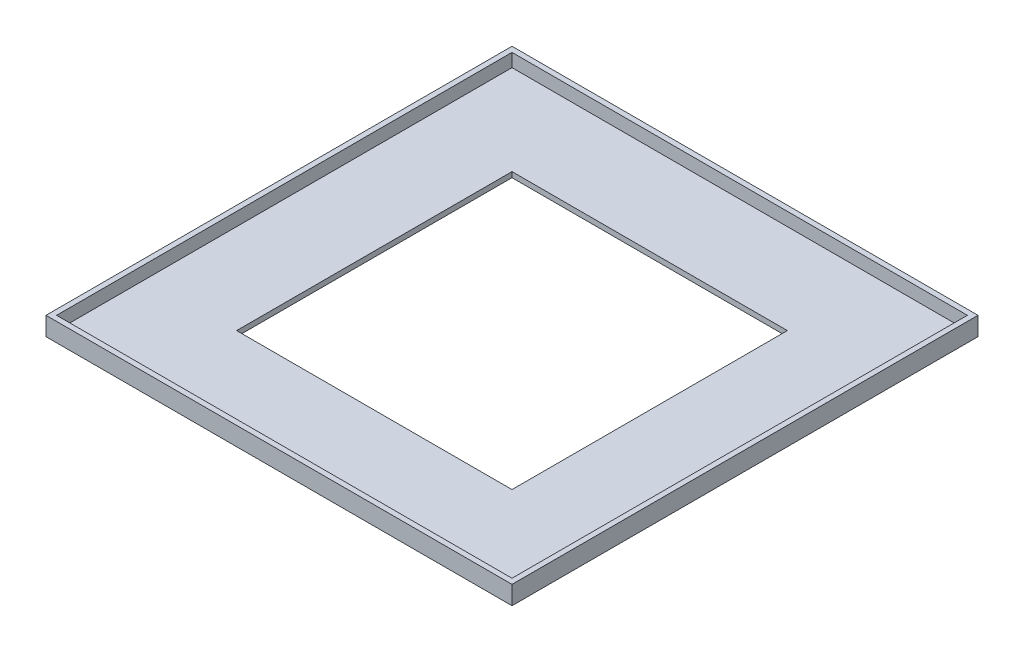
ISO-10303-21;
HEADER;
FILE_DESCRIPTION(('STEP AP214'),'2;1');
FILE_NAME('part.step','',(''),(''),'','','');
FILE_SCHEMA(('AUTOMOTIVE_DESIGN { 1 0 10303 214 1 1 1 1 }'));
ENDSEC;
DATA;
#1=APPLICATION_CONTEXT('core data for automotive mechanical design processes');
#2=APPLICATION_PROTOCOL_DEFINITION('international standard','automotive_design',2000,#1);
#3=PRODUCT_CONTEXT('',#1,'mechanical');
#4=PRODUCT('Part','Part','',(#3));
#5=PRODUCT_RELATED_PRODUCT_CATEGORY('part','',(#4));
#6=PRODUCT_DEFINITION_FORMATION('','',#4);
#7=PRODUCT_DEFINITION_CONTEXT('part definition',#1,'design');
#8=PRODUCT_DEFINITION('design','',#6,#7);
#9=PRODUCT_DEFINITION_SHAPE('','',#8);
#10=(LENGTH_UNIT() NAMED_UNIT(*) SI_UNIT(.MILLI.,.METRE.));
#11=(NAMED_UNIT(*) PLANE_ANGLE_UNIT() SI_UNIT($,.RADIAN.));
#12=(NAMED_UNIT(*) SI_UNIT($,.STERADIAN.) SOLID_ANGLE_UNIT());
#13=UNCERTAINTY_MEASURE_WITH_UNIT(LENGTH_MEASURE(1.E-05),#10,'distance_accuracy_value','');
#14=(GEOMETRIC_REPRESENTATION_CONTEXT(3) GLOBAL_UNCERTAINTY_ASSIGNED_CONTEXT((#13)) GLOBAL_UNIT_ASSIGNED_CONTEXT((#10,
#11,#12)) REPRESENTATION_CONTEXT('',''));
#15=CARTESIAN_POINT('',(0.,0.,0.));
#16=DIRECTION('',(0.,0.,1.));
#17=DIRECTION('',(1.,0.,0.));
#18=AXIS2_PLACEMENT_3D('',#15,#16,#17);
#19=CARTESIAN_POINT('',(44.,3.5,-44.));
#20=DIRECTION('',(-1.,0.,0.));
#21=DIRECTION('',(0.,0.,1.));
#22=AXIS2_PLACEMENT_3D('',#19,#20,#21);
#23=PLANE('',#22);
#24=DIRECTION('',(0.,0.,-1.));
#25=VECTOR('',#24,1.);
#26=CARTESIAN_POINT('',(44.,0.,-44.));
#27=LINE('',#26,#25);
#28=CARTESIAN_POINT('',(44.,0.,44.));
#29=VERTEX_POINT('',#28);
#30=CARTESIAN_POINT('',(44.,0.,-44.));
#31=VERTEX_POINT('',#30);
#32=EDGE_CURVE('E185',#29,#31,#27,.T.);
#33=ORIENTED_EDGE('',*,*,#32,.T.);
#34=DIRECTION('',(0.,-1.,0.));
#35=VECTOR('',#34,1.);
#36=CARTESIAN_POINT('',(44.,3.5,-44.));
#37=LINE('',#36,#35);
#38=CARTESIAN_POINT('',(44.,3.5,-44.));
#39=VERTEX_POINT('',#38);
#40=EDGE_CURVE('E11',#39,#31,#37,.T.);
#41=ORIENTED_EDGE('',*,*,#40,.F.);
#42=DIRECTION('',(0.,0.,-1.));
#43=VECTOR('',#42,1.);
#44=CARTESIAN_POINT('',(44.,3.5,-44.));
#45=LINE('',#44,#43);
#46=CARTESIAN_POINT('',(44.,3.5,44.));
#47=VERTEX_POINT('',#46);
#48=EDGE_CURVE('E192',#47,#39,#45,.T.);
#49=ORIENTED_EDGE('',*,*,#48,.F.);
#50=DIRECTION('',(0.,-1.,0.));
#51=VECTOR('',#50,1.);
#52=CARTESIAN_POINT('',(44.,3.5,44.));
#53=LINE('',#52,#51);
#54=EDGE_CURVE('E202',#47,#29,#53,.T.);
#55=ORIENTED_EDGE('',*,*,#54,.T.);
#56=EDGE_LOOP('',(#33,#41,#49,#55));
#57=FACE_BOUND('',#56,.T.);
#58=ADVANCED_FACE('F34',(#57),#23,.F.);
#59=CARTESIAN_POINT('',(-44.,3.5,-44.));
#60=DIRECTION('',(0.,0.,1.));
#61=DIRECTION('',(1.,0.,0.));
#62=AXIS2_PLACEMENT_3D('',#59,#60,#61);
#63=PLANE('',#62);
#64=DIRECTION('',(-1.,0.,0.));
#65=VECTOR('',#64,1.);
#66=CARTESIAN_POINT('',(-44.,0.,-44.));
#67=LINE('',#66,#65);
#68=CARTESIAN_POINT('',(-44.,0.,-44.));
#69=VERTEX_POINT('',#68);
#70=EDGE_CURVE('E205',#31,#69,#67,.T.);
#71=ORIENTED_EDGE('',*,*,#70,.T.);
#72=DIRECTION('',(0.,-1.,0.));
#73=VECTOR('',#72,1.);
#74=CARTESIAN_POINT('',(-44.,3.5,-44.));
#75=LINE('',#74,#73);
#76=CARTESIAN_POINT('',(-44.,3.5,-44.));
#77=VERTEX_POINT('',#76);
#78=EDGE_CURVE('E41',#77,#69,#75,.T.);
#79=ORIENTED_EDGE('',*,*,#78,.F.);
#80=DIRECTION('',(-1.,0.,0.));
#81=VECTOR('',#80,1.);
#82=CARTESIAN_POINT('',(-44.,3.5,-44.));
#83=LINE('',#82,#81);
#84=EDGE_CURVE('E195',#39,#77,#83,.T.);
#85=ORIENTED_EDGE('',*,*,#84,.F.);
#86=ORIENTED_EDGE('',*,*,#40,.T.);
#87=EDGE_LOOP('',(#71,#79,#85,#86));
#88=FACE_BOUND('',#87,.T.);
#89=ADVANCED_FACE('F233',(#88),#63,.F.);
#90=CARTESIAN_POINT('',(-44.,3.5,-44.));
#91=DIRECTION('',(1.,0.,0.));
#92=DIRECTION('',(0.,0.,-1.));
#93=AXIS2_PLACEMENT_3D('',#90,#91,#92);
#94=PLANE('',#93);
#95=DIRECTION('',(0.,0.,1.));
#96=VECTOR('',#95,1.);
#97=CARTESIAN_POINT('',(-44.,0.,-44.));
#98=LINE('',#97,#96);
#99=CARTESIAN_POINT('',(-44.,0.,44.));
#100=VERTEX_POINT('',#99);
#101=EDGE_CURVE('E207',#69,#100,#98,.T.);
#102=ORIENTED_EDGE('',*,*,#101,.T.);
#103=DIRECTION('',(0.,-1.,0.));
#104=VECTOR('',#103,1.);
#105=CARTESIAN_POINT('',(-44.,3.5,44.));
#106=LINE('',#105,#104);
#107=CARTESIAN_POINT('',(-44.,3.5,44.));
#108=VERTEX_POINT('',#107);
#109=EDGE_CURVE('E212',#108,#100,#106,.T.);
#110=ORIENTED_EDGE('',*,*,#109,.F.);
#111=DIRECTION('',(0.,0.,1.));
#112=VECTOR('',#111,1.);
#113=CARTESIAN_POINT('',(-44.,3.5,-44.));
#114=LINE('',#113,#112);
#115=EDGE_CURVE('E198',#77,#108,#114,.T.);
#116=ORIENTED_EDGE('',*,*,#115,.F.);
#117=ORIENTED_EDGE('',*,*,#78,.T.);
#118=EDGE_LOOP('',(#102,#110,#116,#117));
#119=FACE_BOUND('',#118,.T.);
#120=ADVANCED_FACE('F219',(#119),#94,.F.);
#121=CARTESIAN_POINT('',(-44.,3.5,44.));
#122=DIRECTION('',(0.,0.,-1.));
#123=DIRECTION('',(-1.,0.,0.));
#124=AXIS2_PLACEMENT_3D('',#121,#122,#123);
#125=PLANE('',#124);
#126=DIRECTION('',(1.,0.,0.));
#127=VECTOR('',#126,1.);
#128=CARTESIAN_POINT('',(-44.,0.,44.));
#129=LINE('',#128,#127);
#130=EDGE_CURVE('E196',#100,#29,#129,.T.);
#131=ORIENTED_EDGE('',*,*,#130,.T.);
#132=ORIENTED_EDGE('',*,*,#54,.F.);
#133=DIRECTION('',(1.,0.,0.));
#134=VECTOR('',#133,1.);
#135=CARTESIAN_POINT('',(-44.,3.5,44.));
#136=LINE('',#135,#134);
#137=EDGE_CURVE('E200',#108,#47,#136,.T.);
#138=ORIENTED_EDGE('',*,*,#137,.F.);
#139=ORIENTED_EDGE('',*,*,#109,.T.);
#140=EDGE_LOOP('',(#131,#132,#138,#139));
#141=FACE_BOUND('',#140,.T.);
#142=ADVANCED_FACE('F226',(#141),#125,.F.);
#143=CARTESIAN_POINT('',(0.,3.5,0.));
#144=DIRECTION('',(0.,1.,0.));
#145=DIRECTION('',(0.,0.,1.));
#146=AXIS2_PLACEMENT_3D('',#143,#144,#145);
#147=PLANE('',#146);
#148=DIRECTION('',(0.,0.,-1.));
#149=VECTOR('',#148,1.);
#150=CARTESIAN_POINT('',(43.,3.5,-43.));
#151=LINE('',#150,#149);
#152=CARTESIAN_POINT('',(43.,3.5,43.));
#153=VERTEX_POINT('',#152);
#154=CARTESIAN_POINT('',(43.,3.5,-43.));
#155=VERTEX_POINT('',#154);
#156=EDGE_CURVE('E156',#153,#155,#151,.T.);
#157=ORIENTED_EDGE('',*,*,#156,.F.);
#158=DIRECTION('',(1.,0.,0.));
#159=VECTOR('',#158,1.);
#160=CARTESIAN_POINT('',(-43.,3.5,43.));
#161=LINE('',#160,#159);
#162=CARTESIAN_POINT('',(-43.,3.5,43.));
#163=VERTEX_POINT('',#162);
#164=EDGE_CURVE('E164',#163,#153,#161,.T.);
#165=ORIENTED_EDGE('',*,*,#164,.F.);
#166=DIRECTION('',(0.,0.,1.));
#167=VECTOR('',#166,1.);
#168=CARTESIAN_POINT('',(-43.,3.5,-43.));
#169=LINE('',#168,#167);
#170=CARTESIAN_POINT('',(-43.,3.5,-43.));
#171=VERTEX_POINT('',#170);
#172=EDGE_CURVE('E178',#171,#163,#169,.T.);
#173=ORIENTED_EDGE('',*,*,#172,.F.);
#174=DIRECTION('',(-1.,0.,0.));
#175=VECTOR('',#174,1.);
#176=CARTESIAN_POINT('',(-43.,3.5,-43.));
#177=LINE('',#176,#175);
#178=EDGE_CURVE('E175',#155,#171,#177,.T.);
#179=ORIENTED_EDGE('',*,*,#178,.F.);
#180=EDGE_LOOP('',(#157,#165,#173,#179));
#181=FACE_BOUND('',#180,.T.);
#182=ORIENTED_EDGE('',*,*,#48,.T.);
#183=ORIENTED_EDGE('',*,*,#84,.T.);
#184=ORIENTED_EDGE('',*,*,#115,.T.);
#185=ORIENTED_EDGE('',*,*,#137,.T.);
#186=EDGE_LOOP('',(#182,#183,#184,#185));
#187=FACE_BOUND('',#186,.T.);
#188=ADVANCED_FACE('F232',(#181,#187),#147,.T.);
#189=CARTESIAN_POINT('',(0.,0.,0.));
#190=DIRECTION('',(0.,1.,0.));
#191=DIRECTION('',(0.,0.,1.));
#192=AXIS2_PLACEMENT_3D('',#189,#190,#191);
#193=PLANE('',#192);
#194=DIRECTION('',(1.,0.,0.));
#195=VECTOR('',#194,1.);
#196=CARTESIAN_POINT('',(-26.,0.,26.));
#197=LINE('',#196,#195);
#198=CARTESIAN_POINT('',(-26.,0.,26.));
#199=VERTEX_POINT('',#198);
#200=CARTESIAN_POINT('',(26.,0.,26.));
#201=VERTEX_POINT('',#200);
#202=EDGE_CURVE('E133',#199,#201,#197,.T.);
#203=ORIENTED_EDGE('',*,*,#202,.T.);
#204=DIRECTION('',(0.,0.,-1.));
#205=VECTOR('',#204,1.);
#206=CARTESIAN_POINT('',(26.,0.,-26.));
#207=LINE('',#206,#205);
#208=CARTESIAN_POINT('',(26.,0.,-26.));
#209=VERTEX_POINT('',#208);
#210=EDGE_CURVE('E125',#201,#209,#207,.T.);
#211=ORIENTED_EDGE('',*,*,#210,.T.);
#212=DIRECTION('',(-1.,0.,0.));
#213=VECTOR('',#212,1.);
#214=CARTESIAN_POINT('',(-26.,0.,-26.));
#215=LINE('',#214,#213);
#216=CARTESIAN_POINT('',(-26.,0.,-26.));
#217=VERTEX_POINT('',#216);
#218=EDGE_CURVE('E136',#209,#217,#215,.T.);
#219=ORIENTED_EDGE('',*,*,#218,.T.);
#220=DIRECTION('',(0.,0.,1.));
#221=VECTOR('',#220,1.);
#222=CARTESIAN_POINT('',(-26.,0.,-26.));
#223=LINE('',#222,#221);
#224=EDGE_CURVE('E53',#217,#199,#223,.T.);
#225=ORIENTED_EDGE('',*,*,#224,.T.);
#226=EDGE_LOOP('',(#203,#211,#219,#225));
#227=FACE_BOUND('',#226,.T.);
#228=ORIENTED_EDGE('',*,*,#32,.F.);
#229=ORIENTED_EDGE('',*,*,#130,.F.);
#230=ORIENTED_EDGE('',*,*,#101,.F.);
#231=ORIENTED_EDGE('',*,*,#70,.F.);
#232=EDGE_LOOP('',(#228,#229,#230,#231));
#233=FACE_BOUND('',#232,.T.);
#234=ADVANCED_FACE('F140',(#227,#233),#193,.F.);
#235=CARTESIAN_POINT('',(43.,1.,-43.));
#236=DIRECTION('',(1.,0.,0.));
#237=DIRECTION('',(0.,0.,-1.));
#238=AXIS2_PLACEMENT_3D('',#235,#236,#237);
#239=PLANE('',#238);
#240=ORIENTED_EDGE('',*,*,#156,.T.);
#241=DIRECTION('',(0.,1.,0.));
#242=VECTOR('',#241,1.);
#243=CARTESIAN_POINT('',(43.,1.,-43.));
#244=LINE('',#243,#242);
#245=CARTESIAN_POINT('',(43.,1.,-43.));
#246=VERTEX_POINT('',#245);
#247=EDGE_CURVE('E173',#246,#155,#244,.T.);
#248=ORIENTED_EDGE('',*,*,#247,.F.);
#249=DIRECTION('',(0.,0.,-1.));
#250=VECTOR('',#249,1.);
#251=CARTESIAN_POINT('',(43.,1.,-43.));
#252=LINE('',#251,#250);
#253=CARTESIAN_POINT('',(43.,1.,43.));
#254=VERTEX_POINT('',#253);
#255=EDGE_CURVE('E160',#254,#246,#252,.T.);
#256=ORIENTED_EDGE('',*,*,#255,.F.);
#257=DIRECTION('',(0.,1.,0.));
#258=VECTOR('',#257,1.);
#259=CARTESIAN_POINT('',(43.,1.,43.));
#260=LINE('',#259,#258);
#261=EDGE_CURVE('E183',#254,#153,#260,.T.);
#262=ORIENTED_EDGE('',*,*,#261,.T.);
#263=EDGE_LOOP('',(#240,#248,#256,#262));
#264=FACE_BOUND('',#263,.T.);
#265=ADVANCED_FACE('F245',(#264),#239,.F.);
#266=CARTESIAN_POINT('',(-43.,1.,43.));
#267=DIRECTION('',(0.,0.,1.));
#268=DIRECTION('',(1.,0.,0.));
#269=AXIS2_PLACEMENT_3D('',#266,#267,#268);
#270=PLANE('',#269);
#271=ORIENTED_EDGE('',*,*,#164,.T.);
#272=ORIENTED_EDGE('',*,*,#261,.F.);
#273=DIRECTION('',(1.,0.,0.));
#274=VECTOR('',#273,1.);
#275=CARTESIAN_POINT('',(-43.,1.,43.));
#276=LINE('',#275,#274);
#277=CARTESIAN_POINT('',(-43.,1.,43.));
#278=VERTEX_POINT('',#277);
#279=EDGE_CURVE('E170',#278,#254,#276,.T.);
#280=ORIENTED_EDGE('',*,*,#279,.F.);
#281=DIRECTION('',(0.,1.,0.));
#282=VECTOR('',#281,1.);
#283=CARTESIAN_POINT('',(-43.,1.,43.));
#284=LINE('',#283,#282);
#285=EDGE_CURVE('E186',#278,#163,#284,.T.);
#286=ORIENTED_EDGE('',*,*,#285,.T.);
#287=EDGE_LOOP('',(#271,#272,#280,#286));
#288=FACE_BOUND('',#287,.T.);
#289=ADVANCED_FACE('F251',(#288),#270,.F.);
#290=CARTESIAN_POINT('',(-43.,1.,-43.));
#291=DIRECTION('',(-1.,0.,0.));
#292=DIRECTION('',(0.,0.,1.));
#293=AXIS2_PLACEMENT_3D('',#290,#291,#292);
#294=PLANE('',#293);
#295=ORIENTED_EDGE('',*,*,#172,.T.);
#296=ORIENTED_EDGE('',*,*,#285,.F.);
#297=DIRECTION('',(0.,0.,1.));
#298=VECTOR('',#297,1.);
#299=CARTESIAN_POINT('',(-43.,1.,-43.));
#300=LINE('',#299,#298);
#301=CARTESIAN_POINT('',(-43.,1.,-43.));
#302=VERTEX_POINT('',#301);
#303=EDGE_CURVE('E167',#302,#278,#300,.T.);
#304=ORIENTED_EDGE('',*,*,#303,.F.);
#305=DIRECTION('',(0.,1.,0.));
#306=VECTOR('',#305,1.);
#307=CARTESIAN_POINT('',(-43.,1.,-43.));
#308=LINE('',#307,#306);
#309=EDGE_CURVE('E188',#302,#171,#308,.T.);
#310=ORIENTED_EDGE('',*,*,#309,.T.);
#311=EDGE_LOOP('',(#295,#296,#304,#310));
#312=FACE_BOUND('',#311,.T.);
#313=ADVANCED_FACE('F257',(#312),#294,.F.);
#314=CARTESIAN_POINT('',(-43.,1.,-43.));
#315=DIRECTION('',(0.,0.,-1.));
#316=DIRECTION('',(-1.,0.,0.));
#317=AXIS2_PLACEMENT_3D('',#314,#315,#316);
#318=PLANE('',#317);
#319=ORIENTED_EDGE('',*,*,#178,.T.);
#320=ORIENTED_EDGE('',*,*,#309,.F.);
#321=DIRECTION('',(-1.,0.,0.));
#322=VECTOR('',#321,1.);
#323=CARTESIAN_POINT('',(-43.,1.,-43.));
#324=LINE('',#323,#322);
#325=EDGE_CURVE('E163',#246,#302,#324,.T.);
#326=ORIENTED_EDGE('',*,*,#325,.F.);
#327=ORIENTED_EDGE('',*,*,#247,.T.);
#328=EDGE_LOOP('',(#319,#320,#326,#327));
#329=FACE_BOUND('',#328,.T.);
#330=ADVANCED_FACE('F253',(#329),#318,.F.);
#331=CARTESIAN_POINT('',(0.,1.,0.));
#332=DIRECTION('',(0.,1.,0.));
#333=DIRECTION('',(0.,0.,1.));
#334=AXIS2_PLACEMENT_3D('',#331,#332,#333);
#335=PLANE('',#334);
#336=DIRECTION('',(0.,0.,-1.));
#337=VECTOR('',#336,1.);
#338=CARTESIAN_POINT('',(26.,1.,-26.));
#339=LINE('',#338,#337);
#340=CARTESIAN_POINT('',(26.,1.,26.));
#341=VERTEX_POINT('',#340);
#342=CARTESIAN_POINT('',(26.,1.,-26.));
#343=VERTEX_POINT('',#342);
#344=EDGE_CURVE('E128',#341,#343,#339,.T.);
#345=ORIENTED_EDGE('',*,*,#344,.F.);
#346=DIRECTION('',(1.,0.,0.));
#347=VECTOR('',#346,1.);
#348=CARTESIAN_POINT('',(-26.,1.,26.));
#349=LINE('',#348,#347);
#350=CARTESIAN_POINT('',(-26.,1.,26.));
#351=VERTEX_POINT('',#350);
#352=EDGE_CURVE('E143',#351,#341,#349,.T.);
#353=ORIENTED_EDGE('',*,*,#352,.F.);
#354=DIRECTION('',(0.,0.,1.));
#355=VECTOR('',#354,1.);
#356=CARTESIAN_POINT('',(-26.,1.,-26.));
#357=LINE('',#356,#355);
#358=CARTESIAN_POINT('',(-26.,1.,-26.));
#359=VERTEX_POINT('',#358);
#360=EDGE_CURVE('E48',#359,#351,#357,.T.);
#361=ORIENTED_EDGE('',*,*,#360,.F.);
#362=DIRECTION('',(-1.,0.,0.));
#363=VECTOR('',#362,1.);
#364=CARTESIAN_POINT('',(-26.,1.,-26.));
#365=LINE('',#364,#363);
#366=EDGE_CURVE('E151',#343,#359,#365,.T.);
#367=ORIENTED_EDGE('',*,*,#366,.F.);
#368=EDGE_LOOP('',(#345,#353,#361,#367));
#369=FACE_BOUND('',#368,.T.);
#370=ORIENTED_EDGE('',*,*,#255,.T.);
#371=ORIENTED_EDGE('',*,*,#325,.T.);
#372=ORIENTED_EDGE('',*,*,#303,.T.);
#373=ORIENTED_EDGE('',*,*,#279,.T.);
#374=EDGE_LOOP('',(#370,#371,#372,#373));
#375=FACE_BOUND('',#374,.T.);
#376=ADVANCED_FACE('F256',(#369,#375),#335,.T.);
#377=CARTESIAN_POINT('',(26.,0.,-26.));
#378=DIRECTION('',(1.,0.,0.));
#379=DIRECTION('',(0.,0.,-1.));
#380=AXIS2_PLACEMENT_3D('',#377,#378,#379);
#381=PLANE('',#380);
#382=ORIENTED_EDGE('',*,*,#344,.T.);
#383=DIRECTION('',(0.,1.,0.));
#384=VECTOR('',#383,1.);
#385=CARTESIAN_POINT('',(26.,0.,-26.));
#386=LINE('',#385,#384);
#387=EDGE_CURVE('E121',#209,#343,#386,.T.);
#388=ORIENTED_EDGE('',*,*,#387,.F.);
#389=ORIENTED_EDGE('',*,*,#210,.F.);
#390=DIRECTION('',(0.,1.,0.));
#391=VECTOR('',#390,1.);
#392=CARTESIAN_POINT('',(26.,0.,26.));
#393=LINE('',#392,#391);
#394=EDGE_CURVE('E154',#201,#341,#393,.T.);
#395=ORIENTED_EDGE('',*,*,#394,.T.);
#396=EDGE_LOOP('',(#382,#388,#389,#395));
#397=FACE_BOUND('',#396,.T.);
#398=ADVANCED_FACE('F123',(#397),#381,.F.);
#399=CARTESIAN_POINT('',(-26.,0.,26.));
#400=DIRECTION('',(0.,0.,1.));
#401=DIRECTION('',(1.,0.,0.));
#402=AXIS2_PLACEMENT_3D('',#399,#400,#401);
#403=PLANE('',#402);
#404=ORIENTED_EDGE('',*,*,#352,.T.);
#405=ORIENTED_EDGE('',*,*,#394,.F.);
#406=ORIENTED_EDGE('',*,*,#202,.F.);
#407=DIRECTION('',(0.,1.,0.));
#408=VECTOR('',#407,1.);
#409=CARTESIAN_POINT('',(-26.,0.,26.));
#410=LINE('',#409,#408);
#411=EDGE_CURVE('E157',#199,#351,#410,.T.);
#412=ORIENTED_EDGE('',*,*,#411,.T.);
#413=EDGE_LOOP('',(#404,#405,#406,#412));
#414=FACE_BOUND('',#413,.T.);
#415=ADVANCED_FACE('F270',(#414),#403,.F.);
#416=CARTESIAN_POINT('',(-26.,0.,-26.));
#417=DIRECTION('',(-1.,0.,0.));
#418=DIRECTION('',(0.,0.,1.));
#419=AXIS2_PLACEMENT_3D('',#416,#417,#418);
#420=PLANE('',#419);
#421=ORIENTED_EDGE('',*,*,#360,.T.);
#422=ORIENTED_EDGE('',*,*,#411,.F.);
#423=ORIENTED_EDGE('',*,*,#224,.F.);
#424=DIRECTION('',(0.,1.,0.));
#425=VECTOR('',#424,1.);
#426=CARTESIAN_POINT('',(-26.,0.,-26.));
#427=LINE('',#426,#425);
#428=EDGE_CURVE('E132',#217,#359,#427,.T.);
#429=ORIENTED_EDGE('',*,*,#428,.T.);
#430=EDGE_LOOP('',(#421,#422,#423,#429));
#431=FACE_BOUND('',#430,.T.);
#432=ADVANCED_FACE('F273',(#431),#420,.F.);
#433=CARTESIAN_POINT('',(-26.,0.,-26.));
#434=DIRECTION('',(0.,0.,-1.));
#435=DIRECTION('',(-1.,0.,0.));
#436=AXIS2_PLACEMENT_3D('',#433,#434,#435);
#437=PLANE('',#436);
#438=ORIENTED_EDGE('',*,*,#366,.T.);
#439=ORIENTED_EDGE('',*,*,#428,.F.);
#440=ORIENTED_EDGE('',*,*,#218,.F.);
#441=ORIENTED_EDGE('',*,*,#387,.T.);
#442=EDGE_LOOP('',(#438,#439,#440,#441));
#443=FACE_BOUND('',#442,.T.);
#444=ADVANCED_FACE('F137',(#443),#437,.F.);
#445=CLOSED_SHELL('',(#58,#89,#120,#142,#188,#234,#265,#289,#313,#330,#376,#398,#415,#432,#444));
#446=MANIFOLD_SOLID_BREP('B2',#445);
#447=ADVANCED_BREP_SHAPE_REPRESENTATION('',(#18,#446),#14);
#448=SHAPE_DEFINITION_REPRESENTATION(#9,#447);
ENDSEC;
END-ISO-10303-21;
